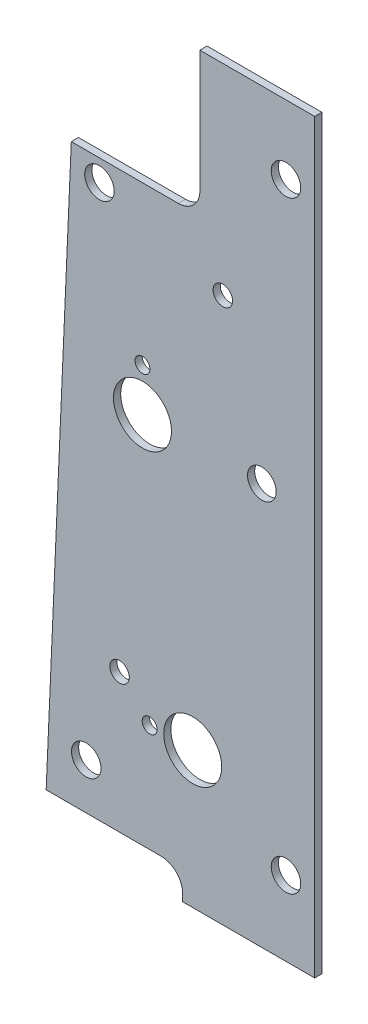
ISO-10303-21;
HEADER;
FILE_DESCRIPTION(('STEP AP214'),'2;1');
FILE_NAME('part.step','',(''),(''),'','','');
FILE_SCHEMA(('AUTOMOTIVE_DESIGN { 1 0 10303 214 1 1 1 1 }'));
ENDSEC;
DATA;
#1=APPLICATION_CONTEXT('core data for automotive mechanical design processes');
#2=APPLICATION_PROTOCOL_DEFINITION('international standard','automotive_design',2000,#1);
#3=PRODUCT_CONTEXT('',#1,'mechanical');
#4=PRODUCT('Part','Part','',(#3));
#5=PRODUCT_RELATED_PRODUCT_CATEGORY('part','',(#4));
#6=PRODUCT_DEFINITION_FORMATION('','',#4);
#7=PRODUCT_DEFINITION_CONTEXT('part definition',#1,'design');
#8=PRODUCT_DEFINITION('design','',#6,#7);
#9=PRODUCT_DEFINITION_SHAPE('','',#8);
#10=(LENGTH_UNIT() NAMED_UNIT(*) SI_UNIT(.MILLI.,.METRE.));
#11=(NAMED_UNIT(*) PLANE_ANGLE_UNIT() SI_UNIT($,.RADIAN.));
#12=(NAMED_UNIT(*) SI_UNIT($,.STERADIAN.) SOLID_ANGLE_UNIT());
#13=UNCERTAINTY_MEASURE_WITH_UNIT(LENGTH_MEASURE(1.E-05),#10,'distance_accuracy_value','');
#14=(GEOMETRIC_REPRESENTATION_CONTEXT(3) GLOBAL_UNCERTAINTY_ASSIGNED_CONTEXT((#13)) GLOBAL_UNIT_ASSIGNED_CONTEXT((#10,
#11,#12)) REPRESENTATION_CONTEXT('',''));
#15=CARTESIAN_POINT('',(0.,0.,0.));
#16=DIRECTION('',(0.,0.,1.));
#17=DIRECTION('',(1.,0.,0.));
#18=AXIS2_PLACEMENT_3D('',#15,#16,#17);
#19=CARTESIAN_POINT('',(-29.7059047619048,82.55,1.5875));
#20=DIRECTION('',(0.,0.,1.));
#21=DIRECTION('',(1.,0.,0.));
#22=AXIS2_PLACEMENT_3D('',#19,#20,#21);
#23=PLANE('',#22);
#24=CARTESIAN_POINT('',(-6.34999999999997,149.86,1.5875));
#25=DIRECTION('',(0.,0.,-1.));
#26=DIRECTION('',(-1.,0.,0.));
#27=AXIS2_PLACEMENT_3D('',#24,#25,#26);
#28=CIRCLE('',#27,3.2639);
#29=CARTESIAN_POINT('',(-9.61389999999997,149.86,1.5875));
#30=VERTEX_POINT('',#29);
#31=EDGE_CURVE('E138',#30,#30,#28,.T.);
#32=ORIENTED_EDGE('',*,*,#31,.T.);
#33=EDGE_LOOP('',(#32));
#34=FACE_BOUND('',#33,.T.);
#35=CARTESIAN_POINT('',(-50.546,16.51,1.5875));
#36=DIRECTION('',(0.,0.,-1.));
#37=DIRECTION('',(-1.,0.,0.));
#38=AXIS2_PLACEMENT_3D('',#35,#36,#37);
#39=CIRCLE('',#38,3.2639);
#40=CARTESIAN_POINT('',(-53.8099,16.51,1.5875));
#41=VERTEX_POINT('',#40);
#42=EDGE_CURVE('E215',#41,#41,#39,.T.);
#43=ORIENTED_EDGE('',*,*,#42,.T.);
#44=EDGE_LOOP('',(#43));
#45=FACE_BOUND('',#44,.T.);
#46=CARTESIAN_POINT('',(-47.625,128.5875,1.5875));
#47=DIRECTION('',(0.,0.,-1.));
#48=DIRECTION('',(-1.,0.,0.));
#49=AXIS2_PLACEMENT_3D('',#46,#47,#48);
#50=CIRCLE('',#49,3.2639);
#51=CARTESIAN_POINT('',(-50.8889,128.5875,1.5875));
#52=VERTEX_POINT('',#51);
#53=EDGE_CURVE('E218',#52,#52,#50,.T.);
#54=ORIENTED_EDGE('',*,*,#53,.T.);
#55=EDGE_LOOP('',(#54));
#56=FACE_BOUND('',#55,.T.);
#57=CARTESIAN_POINT('',(-6.35,16.51,1.5875));
#58=DIRECTION('',(0.,0.,-1.));
#59=DIRECTION('',(-1.,0.,0.));
#60=AXIS2_PLACEMENT_3D('',#57,#58,#59);
#61=CIRCLE('',#60,3.2639);
#62=CARTESIAN_POINT('',(-9.6139,16.51,1.5875));
#63=VERTEX_POINT('',#62);
#64=EDGE_CURVE('E221',#63,#63,#61,.T.);
#65=ORIENTED_EDGE('',*,*,#64,.T.);
#66=EDGE_LOOP('',(#65));
#67=FACE_BOUND('',#66,.T.);
#68=CARTESIAN_POINT('',(-11.684,88.9,1.5875));
#69=DIRECTION('',(0.,0.,-1.));
#70=DIRECTION('',(-1.,0.,0.));
#71=AXIS2_PLACEMENT_3D('',#68,#69,#70);
#72=CIRCLE('',#71,3.175);
#73=CARTESIAN_POINT('',(-14.859,88.9,1.5875));
#74=VERTEX_POINT('',#73);
#75=EDGE_CURVE('E224',#74,#74,#72,.T.);
#76=ORIENTED_EDGE('',*,*,#75,.T.);
#77=EDGE_LOOP('',(#76));
#78=FACE_BOUND('',#77,.T.);
#79=CARTESIAN_POINT('',(-26.9875,30.1625,1.5875));
#80=DIRECTION('',(0.,0.,-1.));
#81=DIRECTION('',(-1.,0.,0.));
#82=AXIS2_PLACEMENT_3D('',#79,#80,#81);
#83=CIRCLE('',#82,6.4135);
#84=CARTESIAN_POINT('',(-33.401,30.1625,1.5875));
#85=VERTEX_POINT('',#84);
#86=EDGE_CURVE('E227',#85,#85,#83,.T.);
#87=ORIENTED_EDGE('',*,*,#86,.T.);
#88=EDGE_LOOP('',(#87));
#89=FACE_BOUND('',#88,.T.);
#90=CARTESIAN_POINT('',(-38.1,88.9,1.5875));
#91=DIRECTION('',(0.,0.,-1.));
#92=DIRECTION('',(-1.,0.,0.));
#93=AXIS2_PLACEMENT_3D('',#90,#91,#92);
#94=CIRCLE('',#93,6.4135);
#95=CARTESIAN_POINT('',(-44.5135,88.9,1.5875));
#96=VERTEX_POINT('',#95);
#97=EDGE_CURVE('E230',#96,#96,#94,.T.);
#98=ORIENTED_EDGE('',*,*,#97,.T.);
#99=EDGE_LOOP('',(#98));
#100=FACE_BOUND('',#99,.T.);
#101=CARTESIAN_POINT('',(-36.5125,30.1625,1.5875));
#102=DIRECTION('',(0.,0.,-1.));
#103=DIRECTION('',(-1.,0.,0.));
#104=AXIS2_PLACEMENT_3D('',#101,#102,#103);
#105=CIRCLE('',#104,1.651);
#106=CARTESIAN_POINT('',(-38.1635,30.1625,1.5875));
#107=VERTEX_POINT('',#106);
#108=EDGE_CURVE('E233',#107,#107,#105,.T.);
#109=ORIENTED_EDGE('',*,*,#108,.T.);
#110=EDGE_LOOP('',(#109));
#111=FACE_BOUND('',#110,.T.);
#112=CARTESIAN_POINT('',(-38.1,98.425,1.5875));
#113=DIRECTION('',(0.,0.,-1.));
#114=DIRECTION('',(-1.,0.,0.));
#115=AXIS2_PLACEMENT_3D('',#112,#113,#114);
#116=CIRCLE('',#115,1.651);
#117=CARTESIAN_POINT('',(-39.751,98.425,1.5875));
#118=VERTEX_POINT('',#117);
#119=EDGE_CURVE('E236',#118,#118,#116,.T.);
#120=ORIENTED_EDGE('',*,*,#119,.T.);
#121=EDGE_LOOP('',(#120));
#122=FACE_BOUND('',#121,.T.);
#123=CARTESIAN_POINT('',(-20.32,120.65,1.5875));
#124=DIRECTION('',(0.,0.,-1.));
#125=DIRECTION('',(-1.,0.,0.));
#126=AXIS2_PLACEMENT_3D('',#123,#124,#125);
#127=CIRCLE('',#126,2.159);
#128=CARTESIAN_POINT('',(-22.479,120.65,1.5875));
#129=VERTEX_POINT('',#128);
#130=EDGE_CURVE('E239',#129,#129,#127,.T.);
#131=ORIENTED_EDGE('',*,*,#130,.T.);
#132=EDGE_LOOP('',(#131));
#133=FACE_BOUND('',#132,.T.);
#134=CARTESIAN_POINT('',(-43.18,37.084,1.5875));
#135=DIRECTION('',(0.,0.,-1.));
#136=DIRECTION('',(-1.,0.,0.));
#137=AXIS2_PLACEMENT_3D('',#134,#135,#136);
#138=CIRCLE('',#137,2.15900000000001);
#139=CARTESIAN_POINT('',(-45.339,37.084,1.5875));
#140=VERTEX_POINT('',#139);
#141=EDGE_CURVE('E242',#140,#140,#138,.T.);
#142=ORIENTED_EDGE('',*,*,#141,.T.);
#143=EDGE_LOOP('',(#142));
#144=FACE_BOUND('',#143,.T.);
#145=CARTESIAN_POINT('',(-33.9725,1.58750000000002,1.5875));
#146=DIRECTION('',(0.,0.,1.));
#147=DIRECTION('',(1.,0.,0.));
#148=AXIS2_PLACEMENT_3D('',#145,#146,#147);
#149=CIRCLE('',#148,4.7625);
#150=CARTESIAN_POINT('',(-33.9725,6.35000000000002,1.5875));
#151=VERTEX_POINT('',#150);
#152=CARTESIAN_POINT('',(-29.21,1.58750000000002,1.5875));
#153=VERTEX_POINT('',#152);
#154=EDGE_CURVE('E244',#151,#153,#149,.F.);
#155=ORIENTED_EDGE('',*,*,#154,.T.);
#156=DIRECTION('',(0.,1.,0.));
#157=VECTOR('',#156,1.);
#158=CARTESIAN_POINT('',(-29.21,6.35000000000002,1.5875));
#159=LINE('',#158,#157);
#160=CARTESIAN_POINT('',(-29.21,0.,1.5875));
#161=VERTEX_POINT('',#160);
#162=EDGE_CURVE('E145',#161,#153,#159,.T.);
#163=ORIENTED_EDGE('',*,*,#162,.F.);
#164=DIRECTION('',(1.,0.,0.));
#165=VECTOR('',#164,1.);
#166=CARTESIAN_POINT('',(-29.21,0.,1.5875));
#167=LINE('',#166,#165);
#168=CARTESIAN_POINT('',(0.,0.,1.5875));
#169=VERTEX_POINT('',#168);
#170=EDGE_CURVE('E144',#169,#161,#167,.F.);
#171=ORIENTED_EDGE('',*,*,#170,.F.);
#172=DIRECTION('',(0.,1.,0.));
#173=VECTOR('',#172,1.);
#174=CARTESIAN_POINT('',(0.,0.,1.5875));
#175=LINE('',#174,#173);
#176=CARTESIAN_POINT('',(0.,165.1,1.5875));
#177=VERTEX_POINT('',#176);
#178=EDGE_CURVE('E156',#177,#169,#175,.F.);
#179=ORIENTED_EDGE('',*,*,#178,.F.);
#180=DIRECTION('',(1.,0.,0.));
#181=VECTOR('',#180,1.);
#182=CARTESIAN_POINT('',(0.,165.1,1.5875));
#183=LINE('',#182,#181);
#184=CARTESIAN_POINT('',(-25.4,165.1,1.5875));
#185=VERTEX_POINT('',#184);
#186=EDGE_CURVE('E133',#185,#177,#183,.T.);
#187=ORIENTED_EDGE('',*,*,#186,.F.);
#188=DIRECTION('',(0.,1.,0.));
#189=VECTOR('',#188,1.);
#190=CARTESIAN_POINT('',(-25.4,165.1,1.5875));
#191=LINE('',#190,#189);
#192=CARTESIAN_POINT('',(-25.4,138.1125,1.5875));
#193=VERTEX_POINT('',#192);
#194=EDGE_CURVE('E91',#193,#185,#191,.T.);
#195=ORIENTED_EDGE('',*,*,#194,.F.);
#196=CARTESIAN_POINT('',(-30.1625,138.1125,1.5875));
#197=DIRECTION('',(0.,0.,1.));
#198=DIRECTION('',(1.,0.,0.));
#199=AXIS2_PLACEMENT_3D('',#196,#197,#198);
#200=CIRCLE('',#199,4.7625);
#201=CARTESIAN_POINT('',(-30.1625,133.35,1.5875));
#202=VERTEX_POINT('',#201);
#203=EDGE_CURVE('E20',#193,#202,#200,.F.);
#204=ORIENTED_EDGE('',*,*,#203,.T.);
#205=DIRECTION('',(1.,0.,0.));
#206=VECTOR('',#205,1.);
#207=CARTESIAN_POINT('',(-25.4,133.35,1.5875));
#208=LINE('',#207,#206);
#209=CARTESIAN_POINT('',(-53.848,133.35,1.5875));
#210=VERTEX_POINT('',#209);
#211=EDGE_CURVE('E96',#210,#202,#208,.T.);
#212=ORIENTED_EDGE('',*,*,#211,.F.);
#213=DIRECTION('',(-0.0437675429811687,-0.999041741961462,0.));
#214=VECTOR('',#213,1.);
#215=CARTESIAN_POINT('',(-53.848,133.35,1.5875));
#216=LINE('',#215,#214);
#217=CARTESIAN_POINT('',(-59.4118095238095,6.35000000000002,1.5875));
#218=VERTEX_POINT('',#217);
#219=EDGE_CURVE('E108',#218,#210,#216,.F.);
#220=ORIENTED_EDGE('',*,*,#219,.F.);
#221=DIRECTION('',(1.,0.,0.));
#222=VECTOR('',#221,1.);
#223=CARTESIAN_POINT('',(-59.4118095238095,6.35000000000002,1.5875));
#224=LINE('',#223,#222);
#225=EDGE_CURVE('E160',#151,#218,#224,.F.);
#226=ORIENTED_EDGE('',*,*,#225,.F.);
#227=EDGE_LOOP('',(#155,#163,#171,#179,#187,#195,#204,#212,#220,#226));
#228=FACE_BOUND('',#227,.T.);
#229=ADVANCED_FACE('F17',(#34,#45,#56,#67,#78,#89,#100,#111,#122,#133,#144,#228),#23,.T.);
#230=CARTESIAN_POINT('',(0.,0.,0.));
#231=DIRECTION('',(1.,0.,0.));
#232=DIRECTION('',(0.,0.,-1.));
#233=AXIS2_PLACEMENT_3D('',#230,#231,#232);
#234=PLANE('',#233);
#235=ORIENTED_EDGE('',*,*,#178,.T.);
#236=DIRECTION('',(0.,0.,-1.));
#237=VECTOR('',#236,1.);
#238=CARTESIAN_POINT('',(0.,0.,0.));
#239=LINE('',#238,#237);
#240=CARTESIAN_POINT('',(0.,0.,0.));
#241=VERTEX_POINT('',#240);
#242=EDGE_CURVE('E141',#241,#169,#239,.F.);
#243=ORIENTED_EDGE('',*,*,#242,.F.);
#244=DIRECTION('',(0.,1.,0.));
#245=VECTOR('',#244,1.);
#246=CARTESIAN_POINT('',(0.,82.55,0.));
#247=LINE('',#246,#245);
#248=CARTESIAN_POINT('',(0.,165.1,0.));
#249=VERTEX_POINT('',#248);
#250=EDGE_CURVE('E128',#241,#249,#247,.T.);
#251=ORIENTED_EDGE('',*,*,#250,.T.);
#252=DIRECTION('',(0.,0.,1.));
#253=VECTOR('',#252,1.);
#254=CARTESIAN_POINT('',(0.,165.1,0.));
#255=LINE('',#254,#253);
#256=EDGE_CURVE('E131',#177,#249,#255,.F.);
#257=ORIENTED_EDGE('',*,*,#256,.F.);
#258=EDGE_LOOP('',(#235,#243,#251,#257));
#259=FACE_BOUND('',#258,.T.);
#260=ADVANCED_FACE('F301',(#259),#234,.T.);
#261=CARTESIAN_POINT('',(0.,165.1,0.));
#262=DIRECTION('',(0.,1.,0.));
#263=DIRECTION('',(0.,0.,1.));
#264=AXIS2_PLACEMENT_3D('',#261,#262,#263);
#265=PLANE('',#264);
#266=ORIENTED_EDGE('',*,*,#186,.T.);
#267=ORIENTED_EDGE('',*,*,#256,.T.);
#268=DIRECTION('',(1.,0.,0.));
#269=VECTOR('',#268,1.);
#270=CARTESIAN_POINT('',(-29.7059047619048,165.1,0.));
#271=LINE('',#270,#269);
#272=CARTESIAN_POINT('',(-25.4,165.1,0.));
#273=VERTEX_POINT('',#272);
#274=EDGE_CURVE('E124',#249,#273,#271,.F.);
#275=ORIENTED_EDGE('',*,*,#274,.T.);
#276=DIRECTION('',(0.,0.,1.));
#277=VECTOR('',#276,1.);
#278=CARTESIAN_POINT('',(-25.4,165.1,0.));
#279=LINE('',#278,#277);
#280=EDGE_CURVE('E120',#185,#273,#279,.F.);
#281=ORIENTED_EDGE('',*,*,#280,.F.);
#282=EDGE_LOOP('',(#266,#267,#275,#281));
#283=FACE_BOUND('',#282,.T.);
#284=ADVANCED_FACE('F307',(#283),#265,.T.);
#285=CARTESIAN_POINT('',(-25.4,165.1,0.));
#286=DIRECTION('',(-1.,0.,0.));
#287=DIRECTION('',(0.,0.,1.));
#288=AXIS2_PLACEMENT_3D('',#285,#286,#287);
#289=PLANE('',#288);
#290=ORIENTED_EDGE('',*,*,#280,.T.);
#291=DIRECTION('',(0.,1.,0.));
#292=VECTOR('',#291,1.);
#293=CARTESIAN_POINT('',(-25.4,82.55,0.));
#294=LINE('',#293,#292);
#295=CARTESIAN_POINT('',(-25.4,138.1125,0.));
#296=VERTEX_POINT('',#295);
#297=EDGE_CURVE('E127',#273,#296,#294,.F.);
#298=ORIENTED_EDGE('',*,*,#297,.T.);
#299=DIRECTION('',(0.,0.,1.));
#300=VECTOR('',#299,1.);
#301=CARTESIAN_POINT('',(-25.4,138.1125,0.));
#302=LINE('',#301,#300);
#303=EDGE_CURVE('E102',#296,#193,#302,.T.);
#304=ORIENTED_EDGE('',*,*,#303,.T.);
#305=ORIENTED_EDGE('',*,*,#194,.T.);
#306=EDGE_LOOP('',(#290,#298,#304,#305));
#307=FACE_BOUND('',#306,.T.);
#308=ADVANCED_FACE('F309',(#307),#289,.T.);
#309=CARTESIAN_POINT('',(-30.1625,138.1125,0.));
#310=DIRECTION('',(0.,0.,1.));
#311=DIRECTION('',(1.,0.,0.));
#312=AXIS2_PLACEMENT_3D('',#309,#310,#311);
#313=CYLINDRICAL_SURFACE('',#312,4.7625);
#314=DIRECTION('',(0.,0.,1.));
#315=VECTOR('',#314,1.);
#316=CARTESIAN_POINT('',(-30.1625,133.35,0.));
#317=LINE('',#316,#315);
#318=CARTESIAN_POINT('',(-30.1625,133.35,0.));
#319=VERTEX_POINT('',#318);
#320=EDGE_CURVE('E101',#202,#319,#317,.F.);
#321=ORIENTED_EDGE('',*,*,#320,.F.);
#322=ORIENTED_EDGE('',*,*,#203,.F.);
#323=ORIENTED_EDGE('',*,*,#303,.F.);
#324=CARTESIAN_POINT('',(-30.1625,138.1125,0.));
#325=DIRECTION('',(0.,0.,1.));
#326=DIRECTION('',(1.,0.,0.));
#327=AXIS2_PLACEMENT_3D('',#324,#325,#326);
#328=CIRCLE('',#327,4.7625);
#329=EDGE_CURVE('E113',#296,#319,#328,.F.);
#330=ORIENTED_EDGE('',*,*,#329,.T.);
#331=EDGE_LOOP('',(#321,#322,#323,#330));
#332=FACE_BOUND('',#331,.T.);
#333=ADVANCED_FACE('F111',(#332),#313,.F.);
#334=CARTESIAN_POINT('',(-25.4,133.35,0.));
#335=DIRECTION('',(0.,1.,0.));
#336=DIRECTION('',(0.,0.,1.));
#337=AXIS2_PLACEMENT_3D('',#334,#335,#336);
#338=PLANE('',#337);
#339=DIRECTION('',(0.,0.,1.));
#340=VECTOR('',#339,1.);
#341=CARTESIAN_POINT('',(-53.848,133.35,0.));
#342=LINE('',#341,#340);
#343=CARTESIAN_POINT('',(-53.848,133.35,0.));
#344=VERTEX_POINT('',#343);
#345=EDGE_CURVE('E107',#210,#344,#342,.F.);
#346=ORIENTED_EDGE('',*,*,#345,.F.);
#347=ORIENTED_EDGE('',*,*,#211,.T.);
#348=ORIENTED_EDGE('',*,*,#320,.T.);
#349=DIRECTION('',(1.,0.,0.));
#350=VECTOR('',#349,1.);
#351=CARTESIAN_POINT('',(-29.7059047619048,133.35,0.));
#352=LINE('',#351,#350);
#353=EDGE_CURVE('E212',#319,#344,#352,.F.);
#354=ORIENTED_EDGE('',*,*,#353,.T.);
#355=EDGE_LOOP('',(#346,#347,#348,#354));
#356=FACE_BOUND('',#355,.T.);
#357=ADVANCED_FACE('F104',(#356),#338,.T.);
#358=CARTESIAN_POINT('',(-53.848,133.35,0.));
#359=DIRECTION('',(-0.999041741961462,0.0437675429811687,0.));
#360=DIRECTION('',(-0.0437675429811687,-0.999041741961462,0.));
#361=AXIS2_PLACEMENT_3D('',#358,#359,#360);
#362=PLANE('',#361);
#363=ORIENTED_EDGE('',*,*,#219,.T.);
#364=ORIENTED_EDGE('',*,*,#345,.T.);
#365=DIRECTION('',(-0.043767542981169,-0.999041741961462,0.));
#366=VECTOR('',#365,1.);
#367=CARTESIAN_POINT('',(-53.848,133.35,0.));
#368=LINE('',#367,#366);
#369=CARTESIAN_POINT('',(-59.4118095238096,6.35000000000002,0.));
#370=VERTEX_POINT('',#369);
#371=EDGE_CURVE('E260',#344,#370,#368,.T.);
#372=ORIENTED_EDGE('',*,*,#371,.T.);
#373=DIRECTION('',(0.,0.,1.));
#374=VECTOR('',#373,1.);
#375=CARTESIAN_POINT('',(-59.4118095238095,6.35000000000002,0.));
#376=LINE('',#375,#374);
#377=EDGE_CURVE('E162',#218,#370,#376,.F.);
#378=ORIENTED_EDGE('',*,*,#377,.F.);
#379=EDGE_LOOP('',(#363,#364,#372,#378));
#380=FACE_BOUND('',#379,.T.);
#381=ADVANCED_FACE('F266',(#380),#362,.T.);
#382=CARTESIAN_POINT('',(-59.4118095238095,6.35000000000002,0.));
#383=DIRECTION('',(0.,-1.,0.));
#384=DIRECTION('',(1.,0.,0.));
#385=AXIS2_PLACEMENT_3D('',#382,#383,#384);
#386=PLANE('',#385);
#387=ORIENTED_EDGE('',*,*,#377,.T.);
#388=DIRECTION('',(1.,0.,0.));
#389=VECTOR('',#388,1.);
#390=CARTESIAN_POINT('',(-29.7059047619048,6.35000000000002,0.));
#391=LINE('',#390,#389);
#392=CARTESIAN_POINT('',(-33.9725,6.35000000000002,0.));
#393=VERTEX_POINT('',#392);
#394=EDGE_CURVE('E210',#370,#393,#391,.T.);
#395=ORIENTED_EDGE('',*,*,#394,.T.);
#396=DIRECTION('',(0.,0.,1.));
#397=VECTOR('',#396,1.);
#398=CARTESIAN_POINT('',(-33.9725,6.35000000000002,0.));
#399=LINE('',#398,#397);
#400=EDGE_CURVE('E245',#393,#151,#399,.T.);
#401=ORIENTED_EDGE('',*,*,#400,.T.);
#402=ORIENTED_EDGE('',*,*,#225,.T.);
#403=EDGE_LOOP('',(#387,#395,#401,#402));
#404=FACE_BOUND('',#403,.T.);
#405=ADVANCED_FACE('F291',(#404),#386,.T.);
#406=CARTESIAN_POINT('',(-33.9725,1.58750000000002,0.));
#407=DIRECTION('',(0.,0.,1.));
#408=DIRECTION('',(1.,0.,0.));
#409=AXIS2_PLACEMENT_3D('',#406,#407,#408);
#410=CYLINDRICAL_SURFACE('',#409,4.7625);
#411=DIRECTION('',(0.,0.,1.));
#412=VECTOR('',#411,1.);
#413=CARTESIAN_POINT('',(-29.21,1.58750000000002,0.));
#414=LINE('',#413,#412);
#415=CARTESIAN_POINT('',(-29.21,1.58750000000002,0.));
#416=VERTEX_POINT('',#415);
#417=EDGE_CURVE('E150',#153,#416,#414,.F.);
#418=ORIENTED_EDGE('',*,*,#417,.F.);
#419=ORIENTED_EDGE('',*,*,#154,.F.);
#420=ORIENTED_EDGE('',*,*,#400,.F.);
#421=CARTESIAN_POINT('',(-33.9725,1.58750000000002,0.));
#422=DIRECTION('',(0.,0.,1.));
#423=DIRECTION('',(1.,0.,0.));
#424=AXIS2_PLACEMENT_3D('',#421,#422,#423);
#425=CIRCLE('',#424,4.7625);
#426=EDGE_CURVE('E206',#393,#416,#425,.F.);
#427=ORIENTED_EDGE('',*,*,#426,.T.);
#428=EDGE_LOOP('',(#418,#419,#420,#427));
#429=FACE_BOUND('',#428,.T.);
#430=ADVANCED_FACE('F294',(#429),#410,.F.);
#431=CARTESIAN_POINT('',(-29.21,6.35000000000002,0.));
#432=DIRECTION('',(-1.,0.,0.));
#433=DIRECTION('',(0.,0.,1.));
#434=AXIS2_PLACEMENT_3D('',#431,#432,#433);
#435=PLANE('',#434);
#436=DIRECTION('',(0.,0.,-1.));
#437=VECTOR('',#436,1.);
#438=CARTESIAN_POINT('',(-29.21,0.,0.));
#439=LINE('',#438,#437);
#440=CARTESIAN_POINT('',(-29.21,0.,0.));
#441=VERTEX_POINT('',#440);
#442=EDGE_CURVE('E35',#161,#441,#439,.T.);
#443=ORIENTED_EDGE('',*,*,#442,.F.);
#444=ORIENTED_EDGE('',*,*,#162,.T.);
#445=ORIENTED_EDGE('',*,*,#417,.T.);
#446=DIRECTION('',(0.,1.,0.));
#447=VECTOR('',#446,1.);
#448=CARTESIAN_POINT('',(-29.21,82.55,0.));
#449=LINE('',#448,#447);
#450=EDGE_CURVE('E209',#416,#441,#449,.F.);
#451=ORIENTED_EDGE('',*,*,#450,.T.);
#452=EDGE_LOOP('',(#443,#444,#445,#451));
#453=FACE_BOUND('',#452,.T.);
#454=ADVANCED_FACE('F295',(#453),#435,.T.);
#455=CARTESIAN_POINT('',(-29.21,0.,0.));
#456=DIRECTION('',(0.,-1.,0.));
#457=DIRECTION('',(0.,0.,-1.));
#458=AXIS2_PLACEMENT_3D('',#455,#456,#457);
#459=PLANE('',#458);
#460=ORIENTED_EDGE('',*,*,#170,.T.);
#461=ORIENTED_EDGE('',*,*,#442,.T.);
#462=DIRECTION('',(1.,0.,0.));
#463=VECTOR('',#462,1.);
#464=CARTESIAN_POINT('',(-29.7059047619048,0.,0.));
#465=LINE('',#464,#463);
#466=EDGE_CURVE('E205',#441,#241,#465,.T.);
#467=ORIENTED_EDGE('',*,*,#466,.T.);
#468=ORIENTED_EDGE('',*,*,#242,.T.);
#469=EDGE_LOOP('',(#460,#461,#467,#468));
#470=FACE_BOUND('',#469,.T.);
#471=ADVANCED_FACE('F304',(#470),#459,.T.);
#472=CARTESIAN_POINT('',(-43.18,37.084,7.4295));
#473=DIRECTION('',(0.,0.,-1.));
#474=DIRECTION('',(-1.,0.,0.));
#475=AXIS2_PLACEMENT_3D('',#472,#473,#474);
#476=CYLINDRICAL_SURFACE('',#475,2.15900000000001);
#477=CARTESIAN_POINT('',(-43.18,37.084,0.));
#478=DIRECTION('',(0.,0.,-1.));
#479=DIRECTION('',(-1.,0.,0.));
#480=AXIS2_PLACEMENT_3D('',#477,#478,#479);
#481=CIRCLE('',#480,2.15900000000001);
#482=CARTESIAN_POINT('',(-45.339,37.084,0.));
#483=VERTEX_POINT('',#482);
#484=EDGE_CURVE('E202',#483,#483,#481,.T.);
#485=ORIENTED_EDGE('',*,*,#484,.T.);
#486=EDGE_LOOP('',(#485));
#487=FACE_BOUND('',#486,.T.);
#488=ORIENTED_EDGE('',*,*,#141,.F.);
#489=EDGE_LOOP('',(#488));
#490=FACE_BOUND('',#489,.T.);
#491=ADVANCED_FACE('F366',(#487,#490),#476,.F.);
#492=CARTESIAN_POINT('',(-20.32,120.65,7.4295));
#493=DIRECTION('',(0.,0.,-1.));
#494=DIRECTION('',(-1.,0.,0.));
#495=AXIS2_PLACEMENT_3D('',#492,#493,#494);
#496=CYLINDRICAL_SURFACE('',#495,2.159);
#497=CARTESIAN_POINT('',(-20.32,120.65,0.));
#498=DIRECTION('',(0.,0.,-1.));
#499=DIRECTION('',(-1.,0.,0.));
#500=AXIS2_PLACEMENT_3D('',#497,#498,#499);
#501=CIRCLE('',#500,2.159);
#502=CARTESIAN_POINT('',(-22.479,120.65,0.));
#503=VERTEX_POINT('',#502);
#504=EDGE_CURVE('E199',#503,#503,#501,.T.);
#505=ORIENTED_EDGE('',*,*,#504,.T.);
#506=EDGE_LOOP('',(#505));
#507=FACE_BOUND('',#506,.T.);
#508=ORIENTED_EDGE('',*,*,#130,.F.);
#509=EDGE_LOOP('',(#508));
#510=FACE_BOUND('',#509,.T.);
#511=ADVANCED_FACE('F362',(#507,#510),#496,.F.);
#512=CARTESIAN_POINT('',(-38.1,98.425,1.5875));
#513=DIRECTION('',(0.,0.,-1.));
#514=DIRECTION('',(-1.,0.,0.));
#515=AXIS2_PLACEMENT_3D('',#512,#513,#514);
#516=CYLINDRICAL_SURFACE('',#515,1.651);
#517=CARTESIAN_POINT('',(-38.1,98.425,0.));
#518=DIRECTION('',(0.,0.,-1.));
#519=DIRECTION('',(-1.,0.,0.));
#520=AXIS2_PLACEMENT_3D('',#517,#518,#519);
#521=CIRCLE('',#520,1.651);
#522=CARTESIAN_POINT('',(-39.751,98.425,0.));
#523=VERTEX_POINT('',#522);
#524=EDGE_CURVE('E196',#523,#523,#521,.T.);
#525=ORIENTED_EDGE('',*,*,#524,.T.);
#526=EDGE_LOOP('',(#525));
#527=FACE_BOUND('',#526,.T.);
#528=ORIENTED_EDGE('',*,*,#119,.F.);
#529=EDGE_LOOP('',(#528));
#530=FACE_BOUND('',#529,.T.);
#531=ADVANCED_FACE('F358',(#527,#530),#516,.F.);
#532=CARTESIAN_POINT('',(-36.5125,30.1625,1.5875));
#533=DIRECTION('',(0.,0.,-1.));
#534=DIRECTION('',(-1.,0.,0.));
#535=AXIS2_PLACEMENT_3D('',#532,#533,#534);
#536=CYLINDRICAL_SURFACE('',#535,1.651);
#537=CARTESIAN_POINT('',(-36.5125,30.1625,0.));
#538=DIRECTION('',(0.,0.,-1.));
#539=DIRECTION('',(-1.,0.,0.));
#540=AXIS2_PLACEMENT_3D('',#537,#538,#539);
#541=CIRCLE('',#540,1.651);
#542=CARTESIAN_POINT('',(-38.1635,30.1625,0.));
#543=VERTEX_POINT('',#542);
#544=EDGE_CURVE('E193',#543,#543,#541,.T.);
#545=ORIENTED_EDGE('',*,*,#544,.T.);
#546=EDGE_LOOP('',(#545));
#547=FACE_BOUND('',#546,.T.);
#548=ORIENTED_EDGE('',*,*,#108,.F.);
#549=EDGE_LOOP('',(#548));
#550=FACE_BOUND('',#549,.T.);
#551=ADVANCED_FACE('F354',(#547,#550),#536,.F.);
#552=CARTESIAN_POINT('',(-38.1,88.9,1.5875));
#553=DIRECTION('',(0.,0.,-1.));
#554=DIRECTION('',(-1.,0.,0.));
#555=AXIS2_PLACEMENT_3D('',#552,#553,#554);
#556=CYLINDRICAL_SURFACE('',#555,6.4135);
#557=CARTESIAN_POINT('',(-38.1,88.9,0.));
#558=DIRECTION('',(0.,0.,-1.));
#559=DIRECTION('',(-1.,0.,0.));
#560=AXIS2_PLACEMENT_3D('',#557,#558,#559);
#561=CIRCLE('',#560,6.4135);
#562=CARTESIAN_POINT('',(-44.5135,88.9,0.));
#563=VERTEX_POINT('',#562);
#564=EDGE_CURVE('E190',#563,#563,#561,.T.);
#565=ORIENTED_EDGE('',*,*,#564,.T.);
#566=EDGE_LOOP('',(#565));
#567=FACE_BOUND('',#566,.T.);
#568=ORIENTED_EDGE('',*,*,#97,.F.);
#569=EDGE_LOOP('',(#568));
#570=FACE_BOUND('',#569,.T.);
#571=ADVANCED_FACE('F350',(#567,#570),#556,.F.);
#572=CARTESIAN_POINT('',(-26.9875,30.1625,1.5875));
#573=DIRECTION('',(0.,0.,-1.));
#574=DIRECTION('',(-1.,0.,0.));
#575=AXIS2_PLACEMENT_3D('',#572,#573,#574);
#576=CYLINDRICAL_SURFACE('',#575,6.4135);
#577=CARTESIAN_POINT('',(-26.9875,30.1625,0.));
#578=DIRECTION('',(0.,0.,-1.));
#579=DIRECTION('',(-1.,0.,0.));
#580=AXIS2_PLACEMENT_3D('',#577,#578,#579);
#581=CIRCLE('',#580,6.4135);
#582=CARTESIAN_POINT('',(-33.401,30.1625,0.));
#583=VERTEX_POINT('',#582);
#584=EDGE_CURVE('E187',#583,#583,#581,.T.);
#585=ORIENTED_EDGE('',*,*,#584,.T.);
#586=EDGE_LOOP('',(#585));
#587=FACE_BOUND('',#586,.T.);
#588=ORIENTED_EDGE('',*,*,#86,.F.);
#589=EDGE_LOOP('',(#588));
#590=FACE_BOUND('',#589,.T.);
#591=ADVANCED_FACE('F346',(#587,#590),#576,.F.);
#592=CARTESIAN_POINT('',(-11.684,88.9,1.5875));
#593=DIRECTION('',(0.,0.,-1.));
#594=DIRECTION('',(-1.,0.,0.));
#595=AXIS2_PLACEMENT_3D('',#592,#593,#594);
#596=CYLINDRICAL_SURFACE('',#595,3.175);
#597=CARTESIAN_POINT('',(-11.684,88.9,0.));
#598=DIRECTION('',(0.,0.,-1.));
#599=DIRECTION('',(-1.,0.,0.));
#600=AXIS2_PLACEMENT_3D('',#597,#598,#599);
#601=CIRCLE('',#600,3.175);
#602=CARTESIAN_POINT('',(-14.859,88.9,0.));
#603=VERTEX_POINT('',#602);
#604=EDGE_CURVE('E184',#603,#603,#601,.T.);
#605=ORIENTED_EDGE('',*,*,#604,.T.);
#606=EDGE_LOOP('',(#605));
#607=FACE_BOUND('',#606,.T.);
#608=ORIENTED_EDGE('',*,*,#75,.F.);
#609=EDGE_LOOP('',(#608));
#610=FACE_BOUND('',#609,.T.);
#611=ADVANCED_FACE('F342',(#607,#610),#596,.F.);
#612=CARTESIAN_POINT('',(-6.35,16.51,1.5875));
#613=DIRECTION('',(0.,0.,-1.));
#614=DIRECTION('',(-1.,0.,0.));
#615=AXIS2_PLACEMENT_3D('',#612,#613,#614);
#616=CYLINDRICAL_SURFACE('',#615,3.2639);
#617=CARTESIAN_POINT('',(-6.35,16.51,0.));
#618=DIRECTION('',(0.,0.,-1.));
#619=DIRECTION('',(-1.,0.,0.));
#620=AXIS2_PLACEMENT_3D('',#617,#618,#619);
#621=CIRCLE('',#620,3.2639);
#622=CARTESIAN_POINT('',(-9.6139,16.51,0.));
#623=VERTEX_POINT('',#622);
#624=EDGE_CURVE('E181',#623,#623,#621,.T.);
#625=ORIENTED_EDGE('',*,*,#624,.T.);
#626=EDGE_LOOP('',(#625));
#627=FACE_BOUND('',#626,.T.);
#628=ORIENTED_EDGE('',*,*,#64,.F.);
#629=EDGE_LOOP('',(#628));
#630=FACE_BOUND('',#629,.T.);
#631=ADVANCED_FACE('F338',(#627,#630),#616,.F.);
#632=CARTESIAN_POINT('',(-47.625,128.5875,1.5875));
#633=DIRECTION('',(0.,0.,-1.));
#634=DIRECTION('',(-1.,0.,0.));
#635=AXIS2_PLACEMENT_3D('',#632,#633,#634);
#636=CYLINDRICAL_SURFACE('',#635,3.2639);
#637=CARTESIAN_POINT('',(-47.625,128.5875,0.));
#638=DIRECTION('',(0.,0.,-1.));
#639=DIRECTION('',(-1.,0.,0.));
#640=AXIS2_PLACEMENT_3D('',#637,#638,#639);
#641=CIRCLE('',#640,3.2639);
#642=CARTESIAN_POINT('',(-50.8889,128.5875,0.));
#643=VERTEX_POINT('',#642);
#644=EDGE_CURVE('E178',#643,#643,#641,.T.);
#645=ORIENTED_EDGE('',*,*,#644,.T.);
#646=EDGE_LOOP('',(#645));
#647=FACE_BOUND('',#646,.T.);
#648=ORIENTED_EDGE('',*,*,#53,.F.);
#649=EDGE_LOOP('',(#648));
#650=FACE_BOUND('',#649,.T.);
#651=ADVANCED_FACE('F334',(#647,#650),#636,.F.);
#652=CARTESIAN_POINT('',(-50.546,16.51,1.5875));
#653=DIRECTION('',(0.,0.,-1.));
#654=DIRECTION('',(-1.,0.,0.));
#655=AXIS2_PLACEMENT_3D('',#652,#653,#654);
#656=CYLINDRICAL_SURFACE('',#655,3.2639);
#657=CARTESIAN_POINT('',(-50.546,16.51,0.));
#658=DIRECTION('',(0.,0.,-1.));
#659=DIRECTION('',(-1.,0.,0.));
#660=AXIS2_PLACEMENT_3D('',#657,#658,#659);
#661=CIRCLE('',#660,3.2639);
#662=CARTESIAN_POINT('',(-53.8099,16.51,0.));
#663=VERTEX_POINT('',#662);
#664=EDGE_CURVE('E26',#663,#663,#661,.T.);
#665=ORIENTED_EDGE('',*,*,#664,.T.);
#666=EDGE_LOOP('',(#665));
#667=FACE_BOUND('',#666,.T.);
#668=ORIENTED_EDGE('',*,*,#42,.F.);
#669=EDGE_LOOP('',(#668));
#670=FACE_BOUND('',#669,.T.);
#671=ADVANCED_FACE('F326',(#667,#670),#656,.F.);
#672=CARTESIAN_POINT('',(-6.34999999999997,149.86,1.5875));
#673=DIRECTION('',(0.,0.,-1.));
#674=DIRECTION('',(-1.,0.,0.));
#675=AXIS2_PLACEMENT_3D('',#672,#673,#674);
#676=CYLINDRICAL_SURFACE('',#675,3.2639);
#677=CARTESIAN_POINT('',(-6.34999999999997,149.86,0.));
#678=DIRECTION('',(0.,0.,-1.));
#679=DIRECTION('',(-1.,0.,0.));
#680=AXIS2_PLACEMENT_3D('',#677,#678,#679);
#681=CIRCLE('',#680,3.2639);
#682=CARTESIAN_POINT('',(-9.61389999999997,149.86,0.));
#683=VERTEX_POINT('',#682);
#684=EDGE_CURVE('E11',#683,#683,#681,.T.);
#685=ORIENTED_EDGE('',*,*,#684,.T.);
#686=EDGE_LOOP('',(#685));
#687=FACE_BOUND('',#686,.T.);
#688=ORIENTED_EDGE('',*,*,#31,.F.);
#689=EDGE_LOOP('',(#688));
#690=FACE_BOUND('',#689,.T.);
#691=ADVANCED_FACE('F320',(#687,#690),#676,.F.);
#692=CARTESIAN_POINT('',(-29.7059047619048,82.55,0.));
#693=DIRECTION('',(0.,0.,1.));
#694=DIRECTION('',(1.,0.,0.));
#695=AXIS2_PLACEMENT_3D('',#692,#693,#694);
#696=PLANE('',#695);
#697=ORIENTED_EDGE('',*,*,#684,.F.);
#698=EDGE_LOOP('',(#697));
#699=FACE_BOUND('',#698,.T.);
#700=ORIENTED_EDGE('',*,*,#664,.F.);
#701=EDGE_LOOP('',(#700));
#702=FACE_BOUND('',#701,.T.);
#703=ORIENTED_EDGE('',*,*,#644,.F.);
#704=EDGE_LOOP('',(#703));
#705=FACE_BOUND('',#704,.T.);
#706=ORIENTED_EDGE('',*,*,#624,.F.);
#707=EDGE_LOOP('',(#706));
#708=FACE_BOUND('',#707,.T.);
#709=ORIENTED_EDGE('',*,*,#604,.F.);
#710=EDGE_LOOP('',(#709));
#711=FACE_BOUND('',#710,.T.);
#712=ORIENTED_EDGE('',*,*,#584,.F.);
#713=EDGE_LOOP('',(#712));
#714=FACE_BOUND('',#713,.T.);
#715=ORIENTED_EDGE('',*,*,#564,.F.);
#716=EDGE_LOOP('',(#715));
#717=FACE_BOUND('',#716,.T.);
#718=ORIENTED_EDGE('',*,*,#544,.F.);
#719=EDGE_LOOP('',(#718));
#720=FACE_BOUND('',#719,.T.);
#721=ORIENTED_EDGE('',*,*,#524,.F.);
#722=EDGE_LOOP('',(#721));
#723=FACE_BOUND('',#722,.T.);
#724=ORIENTED_EDGE('',*,*,#504,.F.);
#725=EDGE_LOOP('',(#724));
#726=FACE_BOUND('',#725,.T.);
#727=ORIENTED_EDGE('',*,*,#484,.F.);
#728=EDGE_LOOP('',(#727));
#729=FACE_BOUND('',#728,.T.);
#730=ORIENTED_EDGE('',*,*,#450,.F.);
#731=ORIENTED_EDGE('',*,*,#426,.F.);
#732=ORIENTED_EDGE('',*,*,#394,.F.);
#733=ORIENTED_EDGE('',*,*,#371,.F.);
#734=ORIENTED_EDGE('',*,*,#353,.F.);
#735=ORIENTED_EDGE('',*,*,#329,.F.);
#736=ORIENTED_EDGE('',*,*,#297,.F.);
#737=ORIENTED_EDGE('',*,*,#274,.F.);
#738=ORIENTED_EDGE('',*,*,#250,.F.);
#739=ORIENTED_EDGE('',*,*,#466,.F.);
#740=EDGE_LOOP('',(#730,#731,#732,#733,#734,#735,#736,#737,#738,#739));
#741=FACE_BOUND('',#740,.T.);
#742=ADVANCED_FACE('F271',(#699,#702,#705,#708,#711,#714,#717,#720,#723,#726,#729,#741),#696,.F.);
#743=CLOSED_SHELL('',(#229,#260,#284,#308,#333,#357,#381,#405,#430,#454,#471,#491,#511,#531,
#551,#571,#591,#611,#631,#651,#671,#691,#742));
#744=MANIFOLD_SOLID_BREP('B1',#743);
#745=ADVANCED_BREP_SHAPE_REPRESENTATION('',(#18,#744),#14);
#746=SHAPE_DEFINITION_REPRESENTATION(#9,#745);
ENDSEC;
END-ISO-10303-21;
